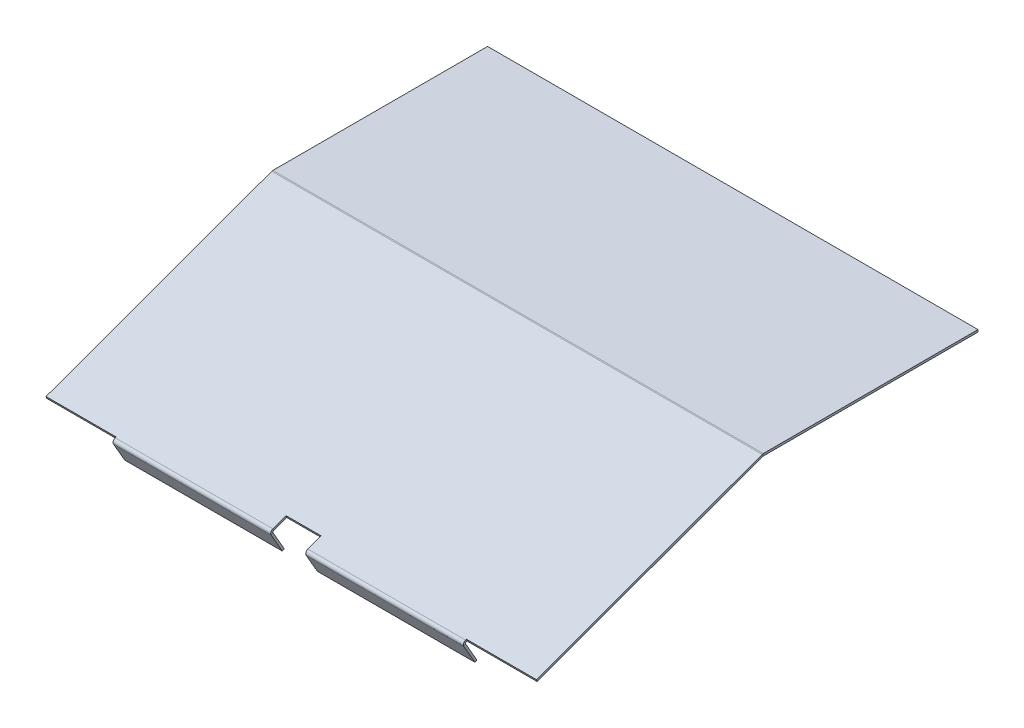
ISO-10303-21;
HEADER;
FILE_DESCRIPTION(('STEP AP214'),'2;1');
FILE_NAME('part.step','',(''),(''),'','','');
FILE_SCHEMA(('AUTOMOTIVE_DESIGN { 1 0 10303 214 1 1 1 1 }'));
ENDSEC;
DATA;
#1=APPLICATION_CONTEXT('core data for automotive mechanical design processes');
#2=APPLICATION_PROTOCOL_DEFINITION('international standard','automotive_design',2000,#1);
#3=PRODUCT_CONTEXT('',#1,'mechanical');
#4=PRODUCT('Part','Part','',(#3));
#5=PRODUCT_RELATED_PRODUCT_CATEGORY('part','',(#4));
#6=PRODUCT_DEFINITION_FORMATION('','',#4);
#7=PRODUCT_DEFINITION_CONTEXT('part definition',#1,'design');
#8=PRODUCT_DEFINITION('design','',#6,#7);
#9=PRODUCT_DEFINITION_SHAPE('','',#8);
#10=(LENGTH_UNIT() NAMED_UNIT(*) SI_UNIT(.MILLI.,.METRE.));
#11=(NAMED_UNIT(*) PLANE_ANGLE_UNIT() SI_UNIT($,.RADIAN.));
#12=(NAMED_UNIT(*) SI_UNIT($,.STERADIAN.) SOLID_ANGLE_UNIT());
#13=UNCERTAINTY_MEASURE_WITH_UNIT(LENGTH_MEASURE(1.E-05),#10,'distance_accuracy_value','');
#14=(GEOMETRIC_REPRESENTATION_CONTEXT(3) GLOBAL_UNCERTAINTY_ASSIGNED_CONTEXT((#13)) GLOBAL_UNIT_ASSIGNED_CONTEXT((#10,
#11,#12)) REPRESENTATION_CONTEXT('',''));
#15=CARTESIAN_POINT('',(0.,0.,0.));
#16=DIRECTION('',(0.,0.,1.));
#17=DIRECTION('',(1.,0.,0.));
#18=AXIS2_PLACEMENT_3D('',#15,#16,#17);
#19=CARTESIAN_POINT('',(0.,53.0658258986964,14.6728415986187));
#20=DIRECTION('',(0.,0.93969262078591,0.342020143325664));
#21=DIRECTION('',(0.,-0.342020143325664,0.93969262078591));
#22=AXIS2_PLACEMENT_3D('',#19,#20,#21);
#23=PLANE('',#22);
#24=DIRECTION('',(0.,0.342020143325664,-0.93969262078591));
#25=VECTOR('',#24,1.);
#26=CARTESIAN_POINT('',(190.5,-59.2236814833031,323.185727572351));
#27=LINE('',#26,#25);
#28=CARTESIAN_POINT('',(190.5,-58.3721076083425,320.846047579899));
#29=VERTEX_POINT('',#28);
#30=CARTESIAN_POINT('',(190.5,-54.8800256630671,311.25163128837));
#31=VERTEX_POINT('',#30);
#32=EDGE_CURVE('E437',#29,#31,#27,.T.);
#33=ORIENTED_EDGE('',*,*,#32,.F.);
#34=DIRECTION('',(-1.,0.,0.));
#35=VECTOR('',#34,1.);
#36=CARTESIAN_POINT('',(190.5,-58.3721076083425,320.846047579899));
#37=LINE('',#36,#35);
#38=CARTESIAN_POINT('',(304.8,-58.3721076083425,320.846047579899));
#39=VERTEX_POINT('',#38);
#40=EDGE_CURVE('E328',#29,#39,#37,.F.);
#41=ORIENTED_EDGE('',*,*,#40,.T.);
#42=DIRECTION('',(0.,-0.342020143325663,0.939692620785911));
#43=VECTOR('',#42,1.);
#44=CARTESIAN_POINT('',(304.8,-59.223681483303,323.185727572351));
#45=LINE('',#44,#43);
#46=CARTESIAN_POINT('',(304.8,-58.1006291195778,320.10016656215));
#47=VERTEX_POINT('',#46);
#48=EDGE_CURVE('E464',#47,#39,#45,.T.);
#49=ORIENTED_EDGE('',*,*,#48,.F.);
#50=DIRECTION('',(1.,0.,0.));
#51=VECTOR('',#50,1.);
#52=CARTESIAN_POINT('',(0.,-58.1006291195778,320.10016656215));
#53=LINE('',#52,#51);
#54=CARTESIAN_POINT('',(305.59375,-58.1006291195778,320.10016656215));
#55=VERTEX_POINT('',#54);
#56=EDGE_CURVE('E416',#47,#55,#53,.T.);
#57=ORIENTED_EDGE('',*,*,#56,.T.);
#58=DIRECTION('',(0.,-0.342020143325664,0.93969262078591));
#59=VECTOR('',#58,1.);
#60=CARTESIAN_POINT('',(305.59375,53.0658258986964,14.6728415986187));
#61=LINE('',#60,#59);
#62=CARTESIAN_POINT('',(305.59375,-58.1377675282441,320.202203501355));
#63=VERTEX_POINT('',#62);
#64=EDGE_CURVE('E406',#55,#63,#61,.T.);
#65=ORIENTED_EDGE('',*,*,#64,.T.);
#66=DIRECTION('',(-1.,0.,0.));
#67=VECTOR('',#66,1.);
#68=CARTESIAN_POINT('',(355.6,-58.1377675282441,320.202203501355));
#69=LINE('',#68,#67);
#70=CARTESIAN_POINT('',(355.6,-58.1377675282441,320.202203501355));
#71=VERTEX_POINT('',#70);
#72=EDGE_CURVE('E452',#71,#63,#69,.T.);
#73=ORIENTED_EDGE('',*,*,#72,.F.);
#74=DIRECTION('',(0.,-0.342020143325664,0.93969262078591));
#75=VECTOR('',#74,1.);
#76=CARTESIAN_POINT('',(355.6,-59.223681483303,323.185727572351));
#77=LINE('',#76,#75);
#78=CARTESIAN_POINT('',(355.6,1.44733961996853,156.493467075854));
#79=VERTEX_POINT('',#78);
#80=EDGE_CURVE('E476',#79,#71,#77,.T.);
#81=ORIENTED_EDGE('',*,*,#80,.F.);
#82=DIRECTION('',(-1.,0.,0.));
#83=VECTOR('',#82,1.);
#84=CARTESIAN_POINT('',(0.,1.44733961996851,156.493467075854));
#85=LINE('',#84,#83);
#86=CARTESIAN_POINT('',(0.,1.44733961996852,156.493467075854));
#87=VERTEX_POINT('',#86);
#88=EDGE_CURVE('E484',#79,#87,#85,.T.);
#89=ORIENTED_EDGE('',*,*,#88,.T.);
#90=DIRECTION('',(0.,0.342020143325664,-0.93969262078591));
#91=VECTOR('',#90,1.);
#92=CARTESIAN_POINT('',(0.,1.49176203549761,156.371417492271));
#93=LINE('',#92,#91);
#94=CARTESIAN_POINT('',(0.,-58.1377675282441,320.202203501355));
#95=VERTEX_POINT('',#94);
#96=EDGE_CURVE('E473',#95,#87,#93,.T.);
#97=ORIENTED_EDGE('',*,*,#96,.F.);
#98=DIRECTION('',(-1.,0.,0.));
#99=VECTOR('',#98,1.);
#100=CARTESIAN_POINT('',(0.,-58.1377675282441,320.202203501355));
#101=LINE('',#100,#99);
#102=CARTESIAN_POINT('',(50.00625,-58.1377675282441,320.202203501355));
#103=VERTEX_POINT('',#102);
#104=EDGE_CURVE('E455',#103,#95,#101,.T.);
#105=ORIENTED_EDGE('',*,*,#104,.F.);
#106=DIRECTION('',(0.,0.342020143325664,-0.93969262078591));
#107=VECTOR('',#106,1.);
#108=CARTESIAN_POINT('',(50.00625,53.0658258986964,14.6728415986187));
#109=LINE('',#108,#107);
#110=CARTESIAN_POINT('',(50.00625,-58.1006291195778,320.10016656215));
#111=VERTEX_POINT('',#110);
#112=EDGE_CURVE('E121',#103,#111,#109,.T.);
#113=ORIENTED_EDGE('',*,*,#112,.T.);
#114=DIRECTION('',(1.,0.,0.));
#115=VECTOR('',#114,1.);
#116=CARTESIAN_POINT('',(0.,-58.1006291195778,320.10016656215));
#117=LINE('',#116,#115);
#118=CARTESIAN_POINT('',(50.8,-58.1006291195778,320.10016656215));
#119=VERTEX_POINT('',#118);
#120=EDGE_CURVE('E432',#111,#119,#117,.T.);
#121=ORIENTED_EDGE('',*,*,#120,.T.);
#122=DIRECTION('',(0.,0.342020143325663,-0.939692620785911));
#123=VECTOR('',#122,1.);
#124=CARTESIAN_POINT('',(50.8,-59.223681483303,323.185727572351));
#125=LINE('',#124,#123);
#126=CARTESIAN_POINT('',(50.8,-58.3721076083425,320.846047579899));
#127=VERTEX_POINT('',#126);
#128=EDGE_CURVE('E453',#127,#119,#125,.T.);
#129=ORIENTED_EDGE('',*,*,#128,.F.);
#130=DIRECTION('',(-1.,0.,0.));
#131=VECTOR('',#130,1.);
#132=CARTESIAN_POINT('',(50.8,-58.3721076083425,320.846047579899));
#133=LINE('',#132,#131);
#134=CARTESIAN_POINT('',(165.1,-58.3721076083425,320.846047579899));
#135=VERTEX_POINT('',#134);
#136=EDGE_CURVE('E380',#127,#135,#133,.F.);
#137=ORIENTED_EDGE('',*,*,#136,.T.);
#138=DIRECTION('',(0.,-0.342020143325664,0.93969262078591));
#139=VECTOR('',#138,1.);
#140=CARTESIAN_POINT('',(165.1,-59.2236814833031,323.185727572351));
#141=LINE('',#140,#139);
#142=CARTESIAN_POINT('',(165.1,-54.8800256630671,311.25163128837));
#143=VERTEX_POINT('',#142);
#144=EDGE_CURVE('E434',#143,#135,#141,.T.);
#145=ORIENTED_EDGE('',*,*,#144,.F.);
#146=DIRECTION('',(-1.,0.,0.));
#147=VECTOR('',#146,1.);
#148=CARTESIAN_POINT('',(165.1,-54.8800256630671,311.25163128837));
#149=LINE('',#148,#147);
#150=EDGE_CURVE('E439',#31,#143,#149,.T.);
#151=ORIENTED_EDGE('',*,*,#150,.F.);
#152=EDGE_LOOP('',(#33,#41,#49,#57,#65,#73,#81,#89,#97,#105,#113,#121,#129,#137,#145,#151));
#153=FACE_BOUND('',#152,.T.);
#154=ADVANCED_FACE('F98',(#153),#23,.T.);
#155=CARTESIAN_POINT('',(0.,51.5740638631988,14.1298846210893));
#156=DIRECTION('',(0.,0.93969262078591,0.342020143325664));
#157=DIRECTION('',(0.,-0.342020143325664,0.93969262078591));
#158=AXIS2_PLACEMENT_3D('',#155,#156,#157);
#159=PLANE('',#158);
#160=DIRECTION('',(-1.,0.,0.));
#161=VECTOR('',#160,1.);
#162=CARTESIAN_POINT('',(190.5,-59.8638696438402,320.30309060237));
#163=LINE('',#162,#161);
#164=CARTESIAN_POINT('',(190.5,-59.8638696438402,320.30309060237));
#165=VERTEX_POINT('',#164);
#166=CARTESIAN_POINT('',(304.8,-59.8638696438402,320.30309060237));
#167=VERTEX_POINT('',#166);
#168=EDGE_CURVE('E339',#165,#167,#163,.F.);
#169=ORIENTED_EDGE('',*,*,#168,.F.);
#170=DIRECTION('',(0.,0.342020143325664,-0.93969262078591));
#171=VECTOR('',#170,1.);
#172=CARTESIAN_POINT('',(190.500000000001,51.5740638631986,14.1298846210896));
#173=LINE('',#172,#171);
#174=CARTESIAN_POINT('',(190.5,-56.3717876985648,310.70867431084));
#175=VERTEX_POINT('',#174);
#176=EDGE_CURVE('E445',#165,#175,#173,.T.);
#177=ORIENTED_EDGE('',*,*,#176,.T.);
#178=DIRECTION('',(-1.,0.,0.));
#179=VECTOR('',#178,1.);
#180=CARTESIAN_POINT('',(0.,-56.3717876985648,310.70867431084));
#181=LINE('',#180,#179);
#182=CARTESIAN_POINT('',(165.1,-56.3717876985648,310.70867431084));
#183=VERTEX_POINT('',#182);
#184=EDGE_CURVE('E543',#175,#183,#181,.T.);
#185=ORIENTED_EDGE('',*,*,#184,.T.);
#186=DIRECTION('',(0.,-0.342020143325664,0.93969262078591));
#187=VECTOR('',#186,1.);
#188=CARTESIAN_POINT('',(165.1,51.5740638631988,14.1298846210893));
#189=LINE('',#188,#187);
#190=CARTESIAN_POINT('',(165.1,-59.8638696438401,320.30309060237));
#191=VERTEX_POINT('',#190);
#192=EDGE_CURVE('E449',#183,#191,#189,.T.);
#193=ORIENTED_EDGE('',*,*,#192,.T.);
#194=DIRECTION('',(-1.,0.,0.));
#195=VECTOR('',#194,1.);
#196=CARTESIAN_POINT('',(50.8,-59.8638696438401,320.30309060237));
#197=LINE('',#196,#195);
#198=CARTESIAN_POINT('',(50.8,-59.8638696438401,320.30309060237));
#199=VERTEX_POINT('',#198);
#200=EDGE_CURVE('E393',#199,#191,#197,.F.);
#201=ORIENTED_EDGE('',*,*,#200,.F.);
#202=DIRECTION('',(0.,0.342020143325664,-0.93969262078591));
#203=VECTOR('',#202,1.);
#204=CARTESIAN_POINT('',(50.8,51.5740638631988,14.1298846210893));
#205=LINE('',#204,#203);
#206=CARTESIAN_POINT('',(50.8,-59.5923911550754,319.557209584621));
#207=VERTEX_POINT('',#206);
#208=EDGE_CURVE('E470',#199,#207,#205,.T.);
#209=ORIENTED_EDGE('',*,*,#208,.T.);
#210=DIRECTION('',(1.,0.,0.));
#211=VECTOR('',#210,1.);
#212=CARTESIAN_POINT('',(50.00625,-59.5923911550754,319.557209584621));
#213=LINE('',#212,#211);
#214=CARTESIAN_POINT('',(50.00625,-59.5923911550754,319.557209584621));
#215=VERTEX_POINT('',#214);
#216=EDGE_CURVE('E423',#215,#207,#213,.T.);
#217=ORIENTED_EDGE('',*,*,#216,.F.);
#218=DIRECTION('',(0.,0.342020143325665,-0.93969262078591));
#219=VECTOR('',#218,1.);
#220=CARTESIAN_POINT('',(50.00625,-60.7154435188006,322.642770594821));
#221=LINE('',#220,#219);
#222=CARTESIAN_POINT('',(50.00625,-59.6295295637417,319.659246523826));
#223=VERTEX_POINT('',#222);
#224=EDGE_CURVE('E420',#223,#215,#221,.T.);
#225=ORIENTED_EDGE('',*,*,#224,.F.);
#226=DIRECTION('',(-1.,0.,0.));
#227=VECTOR('',#226,1.);
#228=CARTESIAN_POINT('',(0.,-59.6295295637417,319.659246523826));
#229=LINE('',#228,#227);
#230=CARTESIAN_POINT('',(0.,-59.6295295637417,319.659246523826));
#231=VERTEX_POINT('',#230);
#232=EDGE_CURVE('E541',#223,#231,#229,.T.);
#233=ORIENTED_EDGE('',*,*,#232,.T.);
#234=DIRECTION('',(0.,-0.342020143325664,0.93969262078591));
#235=VECTOR('',#234,1.);
#236=CARTESIAN_POINT('',(0.,51.5740638631988,14.1298846210893));
#237=LINE('',#236,#235);
#238=CARTESIAN_POINT('',(0.,-0.0444224155290857,155.950510098325));
#239=VERTEX_POINT('',#238);
#240=EDGE_CURVE('E479',#231,#239,#237,.F.);
#241=ORIENTED_EDGE('',*,*,#240,.T.);
#242=DIRECTION('',(1.,0.,0.));
#243=VECTOR('',#242,1.);
#244=CARTESIAN_POINT('',(355.6,-0.0444224155291133,155.950510098325));
#245=LINE('',#244,#243);
#246=CARTESIAN_POINT('',(355.6,-0.0444224155291118,155.950510098325));
#247=VERTEX_POINT('',#246);
#248=EDGE_CURVE('E490',#247,#239,#245,.F.);
#249=ORIENTED_EDGE('',*,*,#248,.F.);
#250=DIRECTION('',(0.,0.342020143325664,-0.93969262078591));
#251=VECTOR('',#250,1.);
#252=CARTESIAN_POINT('',(355.6,51.5740638631988,14.1298846210893));
#253=LINE('',#252,#251);
#254=CARTESIAN_POINT('',(355.6,-59.6295295637417,319.659246523826));
#255=VERTEX_POINT('',#254);
#256=EDGE_CURVE('E481',#247,#255,#253,.F.);
#257=ORIENTED_EDGE('',*,*,#256,.T.);
#258=DIRECTION('',(-1.,0.,0.));
#259=VECTOR('',#258,1.);
#260=CARTESIAN_POINT('',(0.,-59.6295295637417,319.659246523826));
#261=LINE('',#260,#259);
#262=CARTESIAN_POINT('',(305.59375,-59.6295295637417,319.659246523826));
#263=VERTEX_POINT('',#262);
#264=EDGE_CURVE('E538',#255,#263,#261,.T.);
#265=ORIENTED_EDGE('',*,*,#264,.T.);
#266=DIRECTION('',(0.,-0.342020143325664,0.93969262078591));
#267=VECTOR('',#266,1.);
#268=CARTESIAN_POINT('',(305.59375,-59.5923911550754,319.557209584621));
#269=LINE('',#268,#267);
#270=CARTESIAN_POINT('',(305.59375,-59.5923911550754,319.557209584621));
#271=VERTEX_POINT('',#270);
#272=EDGE_CURVE('E408',#271,#263,#269,.T.);
#273=ORIENTED_EDGE('',*,*,#272,.F.);
#274=DIRECTION('',(1.,0.,0.));
#275=VECTOR('',#274,1.);
#276=CARTESIAN_POINT('',(304.8,-59.5923911550754,319.557209584621));
#277=LINE('',#276,#275);
#278=CARTESIAN_POINT('',(304.8,-59.5923911550754,319.557209584621));
#279=VERTEX_POINT('',#278);
#280=EDGE_CURVE('E403',#279,#271,#277,.T.);
#281=ORIENTED_EDGE('',*,*,#280,.F.);
#282=DIRECTION('',(0.,-0.342020143325664,0.93969262078591));
#283=VECTOR('',#282,1.);
#284=CARTESIAN_POINT('',(304.8,51.5740638631988,14.1298846210893));
#285=LINE('',#284,#283);
#286=EDGE_CURVE('E461',#279,#167,#285,.T.);
#287=ORIENTED_EDGE('',*,*,#286,.T.);
#288=EDGE_LOOP('',(#169,#177,#185,#193,#201,#209,#217,#225,#233,#241,#249,#257,#265,#273,#281,#287));
#289=FACE_BOUND('',#288,.T.);
#290=ADVANCED_FACE('F576',(#289),#159,.F.);
#291=CARTESIAN_POINT('',(355.6,-163.324917210384,281.917211989753));
#292=DIRECTION('',(0.,0.342020143325664,-0.93969262078591));
#293=DIRECTION('',(0.,0.93969262078591,0.342020143325664));
#294=AXIS2_PLACEMENT_3D('',#291,#292,#293);
#295=PLANE('',#294);
#296=DIRECTION('',(0.,0.93969262078591,0.342020143325664));
#297=VECTOR('',#296,1.);
#298=CARTESIAN_POINT('',(305.59375,-163.324917210384,281.917211989753));
#299=LINE('',#298,#297);
#300=EDGE_CURVE('E13',#263,#63,#299,.T.);
#301=ORIENTED_EDGE('',*,*,#300,.F.);
#302=ORIENTED_EDGE('',*,*,#264,.F.);
#303=DIRECTION('',(0.,0.93969262078591,0.342020143325664));
#304=VECTOR('',#303,1.);
#305=CARTESIAN_POINT('',(355.6,-163.324917210384,281.917211989753));
#306=LINE('',#305,#304);
#307=EDGE_CURVE('E456',#255,#71,#306,.T.);
#308=ORIENTED_EDGE('',*,*,#307,.T.);
#309=ORIENTED_EDGE('',*,*,#72,.T.);
#310=EDGE_LOOP('',(#301,#302,#308,#309));
#311=FACE_BOUND('',#310,.T.);
#312=ADVANCED_FACE('F583',(#311),#295,.F.);
#313=CARTESIAN_POINT('',(304.8,-164.410831165443,284.900736060749));
#314=DIRECTION('',(-1.,0.,0.));
#315=DIRECTION('',(0.,0.,1.));
#316=AXIS2_PLACEMENT_3D('',#313,#314,#315);
#317=PLANE('',#316);
#318=DIRECTION('',(0.,0.939692620785923,0.34202014332563));
#319=VECTOR('',#318,1.);
#320=CARTESIAN_POINT('',(304.8,-59.8638696438402,320.30309060237));
#321=LINE('',#320,#319);
#322=EDGE_CURVE('E343',#167,#39,#321,.T.);
#323=ORIENTED_EDGE('',*,*,#322,.F.);
#324=ORIENTED_EDGE('',*,*,#286,.F.);
#325=DIRECTION('',(0.,0.93969262078591,0.342020143325664));
#326=VECTOR('',#325,1.);
#327=CARTESIAN_POINT('',(304.8,-59.5923911550754,319.557209584621));
#328=LINE('',#327,#326);
#329=EDGE_CURVE('E407',#279,#47,#328,.T.);
#330=ORIENTED_EDGE('',*,*,#329,.T.);
#331=ORIENTED_EDGE('',*,*,#48,.T.);
#332=EDGE_LOOP('',(#323,#324,#330,#331));
#333=FACE_BOUND('',#332,.T.);
#334=ADVANCED_FACE('F594',(#333),#317,.F.);
#335=CARTESIAN_POINT('',(190.5,-164.410831165443,284.900736060749));
#336=DIRECTION('',(1.,0.,0.));
#337=DIRECTION('',(0.,0.,-1.));
#338=AXIS2_PLACEMENT_3D('',#335,#336,#337);
#339=PLANE('',#338);
#340=DIRECTION('',(0.,0.939692620785923,0.34202014332563));
#341=VECTOR('',#340,1.);
#342=CARTESIAN_POINT('',(190.5,-59.8638696438402,320.30309060237));
#343=LINE('',#342,#341);
#344=EDGE_CURVE('E333',#165,#29,#343,.T.);
#345=ORIENTED_EDGE('',*,*,#344,.T.);
#346=ORIENTED_EDGE('',*,*,#32,.T.);
#347=DIRECTION('',(0.,0.93969262078591,0.342020143325664));
#348=VECTOR('',#347,1.);
#349=CARTESIAN_POINT('',(190.5,-160.067175345207,272.966639776768));
#350=LINE('',#349,#348);
#351=EDGE_CURVE('E442',#175,#31,#350,.T.);
#352=ORIENTED_EDGE('',*,*,#351,.F.);
#353=ORIENTED_EDGE('',*,*,#176,.F.);
#354=EDGE_LOOP('',(#345,#346,#352,#353));
#355=FACE_BOUND('',#354,.T.);
#356=ADVANCED_FACE('F605',(#355),#339,.F.);
#357=CARTESIAN_POINT('',(0.,-163.324917210384,281.917211989753));
#358=DIRECTION('',(0.,0.342020143325664,-0.93969262078591));
#359=DIRECTION('',(0.,0.93969262078591,0.342020143325664));
#360=AXIS2_PLACEMENT_3D('',#357,#358,#359);
#361=PLANE('',#360);
#362=DIRECTION('',(0.,-0.93969262078591,-0.342020143325664));
#363=VECTOR('',#362,1.);
#364=CARTESIAN_POINT('',(50.00625,-163.324917210384,281.917211989753));
#365=LINE('',#364,#363);
#366=EDGE_CURVE('E106',#103,#223,#365,.T.);
#367=ORIENTED_EDGE('',*,*,#366,.F.);
#368=ORIENTED_EDGE('',*,*,#104,.T.);
#369=DIRECTION('',(0.,0.93969262078591,0.342020143325664));
#370=VECTOR('',#369,1.);
#371=CARTESIAN_POINT('',(0.,-163.324917210384,281.917211989753));
#372=LINE('',#371,#370);
#373=EDGE_CURVE('E458',#231,#95,#372,.T.);
#374=ORIENTED_EDGE('',*,*,#373,.F.);
#375=ORIENTED_EDGE('',*,*,#232,.F.);
#376=EDGE_LOOP('',(#367,#368,#374,#375));
#377=FACE_BOUND('',#376,.T.);
#378=ADVANCED_FACE('F551',(#377),#361,.F.);
#379=CARTESIAN_POINT('',(50.8,-164.410831165443,284.900736060749));
#380=DIRECTION('',(1.,0.,0.));
#381=DIRECTION('',(0.,0.,-1.));
#382=AXIS2_PLACEMENT_3D('',#379,#380,#381);
#383=PLANE('',#382);
#384=DIRECTION('',(0.,0.939692620785918,0.342020143325642));
#385=VECTOR('',#384,1.);
#386=CARTESIAN_POINT('',(50.8,-59.8638696438401,320.30309060237));
#387=LINE('',#386,#385);
#388=EDGE_CURVE('E387',#199,#127,#387,.T.);
#389=ORIENTED_EDGE('',*,*,#388,.T.);
#390=ORIENTED_EDGE('',*,*,#128,.T.);
#391=DIRECTION('',(0.,0.93969262078591,0.342020143325664));
#392=VECTOR('',#391,1.);
#393=CARTESIAN_POINT('',(50.8,-59.5923911550754,319.557209584621));
#394=LINE('',#393,#392);
#395=EDGE_CURVE('E419',#207,#119,#394,.T.);
#396=ORIENTED_EDGE('',*,*,#395,.F.);
#397=ORIENTED_EDGE('',*,*,#208,.F.);
#398=EDGE_LOOP('',(#389,#390,#396,#397));
#399=FACE_BOUND('',#398,.T.);
#400=ADVANCED_FACE('F621',(#399),#383,.F.);
#401=CARTESIAN_POINT('',(165.1,-164.410831165443,284.900736060749));
#402=DIRECTION('',(-1.,0.,0.));
#403=DIRECTION('',(0.,0.,1.));
#404=AXIS2_PLACEMENT_3D('',#401,#402,#403);
#405=PLANE('',#404);
#406=DIRECTION('',(0.,0.939692620785918,0.342020143325642));
#407=VECTOR('',#406,1.);
#408=CARTESIAN_POINT('',(165.1,-59.8638696438401,320.30309060237));
#409=LINE('',#408,#407);
#410=EDGE_CURVE('E397',#191,#135,#409,.T.);
#411=ORIENTED_EDGE('',*,*,#410,.F.);
#412=ORIENTED_EDGE('',*,*,#192,.F.);
#413=DIRECTION('',(0.,0.93969262078591,0.342020143325664));
#414=VECTOR('',#413,1.);
#415=CARTESIAN_POINT('',(165.1,-160.067175345207,272.966639776768));
#416=LINE('',#415,#414);
#417=EDGE_CURVE('E443',#183,#143,#416,.T.);
#418=ORIENTED_EDGE('',*,*,#417,.T.);
#419=ORIENTED_EDGE('',*,*,#144,.T.);
#420=EDGE_LOOP('',(#411,#412,#418,#419));
#421=FACE_BOUND('',#420,.T.);
#422=ADVANCED_FACE('F614',(#421),#405,.F.);
#423=CARTESIAN_POINT('',(355.6,1.5875,0.));
#424=DIRECTION('',(0.,-1.,0.));
#425=DIRECTION('',(0.,0.,-1.));
#426=AXIS2_PLACEMENT_3D('',#423,#424,#425);
#427=PLANE('',#426);
#428=DIRECTION('',(-1.,0.,0.));
#429=VECTOR('',#428,1.);
#430=CARTESIAN_POINT('',(0.,1.58750000000001,155.698578060751));
#431=LINE('',#430,#429);
#432=CARTESIAN_POINT('',(0.,1.58750000000001,155.698578060751));
#433=VERTEX_POINT('',#432);
#434=CARTESIAN_POINT('',(355.6,1.58749999999999,155.698578060751));
#435=VERTEX_POINT('',#434);
#436=EDGE_CURVE('E495',#433,#435,#431,.F.);
#437=ORIENTED_EDGE('',*,*,#436,.T.);
#438=DIRECTION('',(0.,0.,1.));
#439=VECTOR('',#438,1.);
#440=CARTESIAN_POINT('',(355.6,1.5875,0.));
#441=LINE('',#440,#439);
#442=CARTESIAN_POINT('',(355.6,1.5875,0.));
#443=VERTEX_POINT('',#442);
#444=EDGE_CURVE('E518',#443,#435,#441,.T.);
#445=ORIENTED_EDGE('',*,*,#444,.F.);
#446=DIRECTION('',(-1.,0.,0.));
#447=VECTOR('',#446,1.);
#448=CARTESIAN_POINT('',(355.6,1.5875,0.));
#449=LINE('',#448,#447);
#450=CARTESIAN_POINT('',(0.,1.5875,0.));
#451=VERTEX_POINT('',#450);
#452=EDGE_CURVE('E528',#443,#451,#449,.T.);
#453=ORIENTED_EDGE('',*,*,#452,.T.);
#454=DIRECTION('',(0.,0.,1.));
#455=VECTOR('',#454,1.);
#456=CARTESIAN_POINT('',(0.,1.5875,0.));
#457=LINE('',#456,#455);
#458=EDGE_CURVE('E515',#451,#433,#457,.T.);
#459=ORIENTED_EDGE('',*,*,#458,.T.);
#460=EDGE_LOOP('',(#437,#445,#453,#459));
#461=FACE_BOUND('',#460,.T.);
#462=ADVANCED_FACE('F100',(#461),#427,.F.);
#463=CARTESIAN_POINT('',(355.6,0.,0.));
#464=DIRECTION('',(0.,-1.,0.));
#465=DIRECTION('',(0.,0.,-1.));
#466=AXIS2_PLACEMENT_3D('',#463,#464,#465);
#467=PLANE('',#466);
#468=DIRECTION('',(0.,0.,1.));
#469=VECTOR('',#468,1.);
#470=CARTESIAN_POINT('',(355.6,0.,0.));
#471=LINE('',#470,#469);
#472=CARTESIAN_POINT('',(355.6,0.,0.));
#473=VERTEX_POINT('',#472);
#474=CARTESIAN_POINT('',(355.6,0.,155.698578060751));
#475=VERTEX_POINT('',#474);
#476=EDGE_CURVE('E521',#473,#475,#471,.T.);
#477=ORIENTED_EDGE('',*,*,#476,.T.);
#478=DIRECTION('',(-1.,0.,0.));
#479=VECTOR('',#478,1.);
#480=CARTESIAN_POINT('',(0.,0.,155.698578060751));
#481=LINE('',#480,#479);
#482=CARTESIAN_POINT('',(0.,0.,155.698578060751));
#483=VERTEX_POINT('',#482);
#484=EDGE_CURVE('E507',#483,#475,#481,.F.);
#485=ORIENTED_EDGE('',*,*,#484,.F.);
#486=DIRECTION('',(0.,0.,1.));
#487=VECTOR('',#486,1.);
#488=CARTESIAN_POINT('',(0.,0.,0.));
#489=LINE('',#488,#487);
#490=CARTESIAN_POINT('',(0.,0.,0.));
#491=VERTEX_POINT('',#490);
#492=EDGE_CURVE('E530',#491,#483,#489,.T.);
#493=ORIENTED_EDGE('',*,*,#492,.F.);
#494=DIRECTION('',(-1.,0.,0.));
#495=VECTOR('',#494,1.);
#496=CARTESIAN_POINT('',(355.6,0.,0.));
#497=LINE('',#496,#495);
#498=EDGE_CURVE('E536',#473,#491,#497,.T.);
#499=ORIENTED_EDGE('',*,*,#498,.F.);
#500=EDGE_LOOP('',(#477,#485,#493,#499));
#501=FACE_BOUND('',#500,.T.);
#502=ADVANCED_FACE('F689',(#501),#467,.T.);
#503=CARTESIAN_POINT('',(355.6,0.,0.));
#504=DIRECTION('',(-1.,0.,0.));
#505=DIRECTION('',(0.,0.,1.));
#506=AXIS2_PLACEMENT_3D('',#503,#504,#505);
#507=PLANE('',#506);
#508=DIRECTION('',(0.,1.,0.));
#509=VECTOR('',#508,1.);
#510=CARTESIAN_POINT('',(355.6,0.,155.698578060751));
#511=LINE('',#510,#509);
#512=EDGE_CURVE('E512',#475,#435,#511,.T.);
#513=ORIENTED_EDGE('',*,*,#512,.F.);
#514=ORIENTED_EDGE('',*,*,#476,.F.);
#515=DIRECTION('',(0.,-1.,0.));
#516=VECTOR('',#515,1.);
#517=CARTESIAN_POINT('',(355.6,1.5875,0.));
#518=LINE('',#517,#516);
#519=EDGE_CURVE('E525',#443,#473,#518,.T.);
#520=ORIENTED_EDGE('',*,*,#519,.F.);
#521=ORIENTED_EDGE('',*,*,#444,.T.);
#522=EDGE_LOOP('',(#513,#514,#520,#521));
#523=FACE_BOUND('',#522,.T.);
#524=ADVANCED_FACE('F685',(#523),#507,.F.);
#525=CARTESIAN_POINT('',(0.,0.,0.));
#526=DIRECTION('',(-1.,0.,0.));
#527=DIRECTION('',(0.,0.,1.));
#528=AXIS2_PLACEMENT_3D('',#525,#526,#527);
#529=PLANE('',#528);
#530=ORIENTED_EDGE('',*,*,#492,.T.);
#531=DIRECTION('',(0.,1.,0.));
#532=VECTOR('',#531,1.);
#533=CARTESIAN_POINT('',(0.,0.,155.698578060751));
#534=LINE('',#533,#532);
#535=EDGE_CURVE('E501',#483,#433,#534,.T.);
#536=ORIENTED_EDGE('',*,*,#535,.T.);
#537=ORIENTED_EDGE('',*,*,#458,.F.);
#538=DIRECTION('',(0.,-1.,0.));
#539=VECTOR('',#538,1.);
#540=CARTESIAN_POINT('',(0.,1.5875,0.));
#541=LINE('',#540,#539);
#542=EDGE_CURVE('E522',#451,#491,#541,.T.);
#543=ORIENTED_EDGE('',*,*,#542,.T.);
#544=EDGE_LOOP('',(#530,#536,#537,#543));
#545=FACE_BOUND('',#544,.T.);
#546=ADVANCED_FACE('F688',(#545),#529,.T.);
#547=CARTESIAN_POINT('',(355.6,1.5875,0.));
#548=DIRECTION('',(0.,0.,-1.));
#549=DIRECTION('',(0.,1.,0.));
#550=AXIS2_PLACEMENT_3D('',#547,#548,#549);
#551=PLANE('',#550);
#552=ORIENTED_EDGE('',*,*,#542,.F.);
#553=ORIENTED_EDGE('',*,*,#452,.F.);
#554=ORIENTED_EDGE('',*,*,#519,.T.);
#555=ORIENTED_EDGE('',*,*,#498,.T.);
#556=EDGE_LOOP('',(#552,#553,#554,#555));
#557=FACE_BOUND('',#556,.T.);
#558=ADVANCED_FACE('F681',(#557),#551,.T.);
#559=CARTESIAN_POINT('',(355.6,-0.736600000000008,155.698578060751));
#560=DIRECTION('',(1.,0.,0.));
#561=DIRECTION('',(0.,1.,0.));
#562=AXIS2_PLACEMENT_3D('',#559,#560,#561);
#563=PLANE('',#562);
#564=DIRECTION('',(0.,0.93969262078591,0.342020143325664));
#565=VECTOR('',#564,1.);
#566=CARTESIAN_POINT('',(355.6,1.44733961996852,156.493467075854));
#567=LINE('',#566,#565);
#568=EDGE_CURVE('E472',#247,#79,#567,.T.);
#569=ORIENTED_EDGE('',*,*,#568,.F.);
#570=CARTESIAN_POINT('',(355.6,-0.736600000000008,155.698578060751));
#571=DIRECTION('',(-1.,0.,0.));
#572=DIRECTION('',(0.,-1.,0.));
#573=AXIS2_PLACEMENT_3D('',#570,#571,#572);
#574=CIRCLE('',#573,0.736599999999995);
#575=EDGE_CURVE('E504',#475,#247,#574,.F.);
#576=ORIENTED_EDGE('',*,*,#575,.F.);
#577=ORIENTED_EDGE('',*,*,#512,.T.);
#578=CARTESIAN_POINT('',(355.6,-0.736600000000008,155.698578060751));
#579=DIRECTION('',(-1.,0.,0.));
#580=DIRECTION('',(0.,-1.,0.));
#581=AXIS2_PLACEMENT_3D('',#578,#579,#580);
#582=CIRCLE('',#581,2.32409999999999);
#583=EDGE_CURVE('E497',#435,#79,#582,.F.);
#584=ORIENTED_EDGE('',*,*,#583,.T.);
#585=EDGE_LOOP('',(#569,#576,#577,#584));
#586=FACE_BOUND('',#585,.T.);
#587=ADVANCED_FACE('F678',(#586),#563,.T.);
#588=CARTESIAN_POINT('',(0.,-0.736599999999982,155.698578060751));
#589=DIRECTION('',(1.,0.,0.));
#590=DIRECTION('',(0.,1.,0.));
#591=AXIS2_PLACEMENT_3D('',#588,#589,#590);
#592=PLANE('',#591);
#593=CARTESIAN_POINT('',(0.,-0.736599999999982,155.698578060751));
#594=DIRECTION('',(-1.,0.,0.));
#595=DIRECTION('',(0.,-1.,0.));
#596=AXIS2_PLACEMENT_3D('',#593,#594,#595);
#597=CIRCLE('',#596,0.736599999999995);
#598=EDGE_CURVE('E475',#239,#483,#597,.T.);
#599=ORIENTED_EDGE('',*,*,#598,.F.);
#600=DIRECTION('',(0.,0.93969262078591,0.342020143325664));
#601=VECTOR('',#600,1.);
#602=CARTESIAN_POINT('',(0.,-0.0444224155291198,155.950510098325));
#603=LINE('',#602,#601);
#604=EDGE_CURVE('E487',#239,#87,#603,.T.);
#605=ORIENTED_EDGE('',*,*,#604,.T.);
#606=CARTESIAN_POINT('',(0.,-0.736599999999982,155.698578060751));
#607=DIRECTION('',(-1.,0.,0.));
#608=DIRECTION('',(0.,-1.,0.));
#609=AXIS2_PLACEMENT_3D('',#606,#607,#608);
#610=CIRCLE('',#609,2.32409999999999);
#611=EDGE_CURVE('E498',#87,#433,#610,.T.);
#612=ORIENTED_EDGE('',*,*,#611,.T.);
#613=ORIENTED_EDGE('',*,*,#535,.F.);
#614=EDGE_LOOP('',(#599,#605,#612,#613));
#615=FACE_BOUND('',#614,.T.);
#616=ADVANCED_FACE('F568',(#615),#592,.F.);
#617=CARTESIAN_POINT('',(0.,-0.736599999999982,155.698578060751));
#618=DIRECTION('',(-1.,0.,0.));
#619=DIRECTION('',(0.,0.93969262078591,0.342020143325664));
#620=AXIS2_PLACEMENT_3D('',#617,#618,#619);
#621=CYLINDRICAL_SURFACE('',#620,2.32409999999999);
#622=ORIENTED_EDGE('',*,*,#436,.F.);
#623=ORIENTED_EDGE('',*,*,#611,.F.);
#624=ORIENTED_EDGE('',*,*,#88,.F.);
#625=ORIENTED_EDGE('',*,*,#583,.F.);
#626=EDGE_LOOP('',(#622,#623,#624,#625));
#627=FACE_BOUND('',#626,.T.);
#628=ADVANCED_FACE('F563',(#627),#621,.T.);
#629=CARTESIAN_POINT('',(0.,-0.736599999999982,155.698578060751));
#630=DIRECTION('',(-1.,0.,0.));
#631=DIRECTION('',(0.,0.93969262078591,0.342020143325664));
#632=AXIS2_PLACEMENT_3D('',#629,#630,#631);
#633=CYLINDRICAL_SURFACE('',#632,0.736599999999995);
#634=ORIENTED_EDGE('',*,*,#484,.T.);
#635=ORIENTED_EDGE('',*,*,#575,.T.);
#636=ORIENTED_EDGE('',*,*,#248,.T.);
#637=ORIENTED_EDGE('',*,*,#598,.T.);
#638=EDGE_LOOP('',(#634,#635,#636,#637));
#639=FACE_BOUND('',#638,.T.);
#640=ADVANCED_FACE('F570',(#639),#633,.F.);
#641=CARTESIAN_POINT('',(0.,1.49176203549761,156.371417492271));
#642=DIRECTION('',(-1.,0.,0.));
#643=DIRECTION('',(0.,0.,1.));
#644=AXIS2_PLACEMENT_3D('',#641,#642,#643);
#645=PLANE('',#644);
#646=ORIENTED_EDGE('',*,*,#373,.T.);
#647=ORIENTED_EDGE('',*,*,#96,.T.);
#648=ORIENTED_EDGE('',*,*,#604,.F.);
#649=ORIENTED_EDGE('',*,*,#240,.F.);
#650=EDGE_LOOP('',(#646,#647,#648,#649));
#651=FACE_BOUND('',#650,.T.);
#652=ADVANCED_FACE('F559',(#651),#645,.T.);
#653=CARTESIAN_POINT('',(355.6,-59.223681483303,323.185727572351));
#654=DIRECTION('',(1.,0.,0.));
#655=DIRECTION('',(0.,0.,-1.));
#656=AXIS2_PLACEMENT_3D('',#653,#654,#655);
#657=PLANE('',#656);
#658=ORIENTED_EDGE('',*,*,#307,.F.);
#659=ORIENTED_EDGE('',*,*,#256,.F.);
#660=ORIENTED_EDGE('',*,*,#568,.T.);
#661=ORIENTED_EDGE('',*,*,#80,.T.);
#662=EDGE_LOOP('',(#658,#659,#660,#661));
#663=FACE_BOUND('',#662,.T.);
#664=ADVANCED_FACE('F579',(#663),#657,.T.);
#665=CARTESIAN_POINT('',(165.1,-160.067175345207,272.966639776768));
#666=DIRECTION('',(0.,0.342020143325664,-0.93969262078591));
#667=DIRECTION('',(0.,0.93969262078591,0.342020143325664));
#668=AXIS2_PLACEMENT_3D('',#665,#666,#667);
#669=PLANE('',#668);
#670=ORIENTED_EDGE('',*,*,#351,.T.);
#671=ORIENTED_EDGE('',*,*,#150,.T.);
#672=ORIENTED_EDGE('',*,*,#417,.F.);
#673=ORIENTED_EDGE('',*,*,#184,.F.);
#674=EDGE_LOOP('',(#670,#671,#672,#673));
#675=FACE_BOUND('',#674,.T.);
#676=ADVANCED_FACE('F610',(#675),#669,.F.);
#677=CARTESIAN_POINT('',(50.00625,-60.7154435188006,322.642770594821));
#678=DIRECTION('',(1.,0.,0.));
#679=DIRECTION('',(0.,0.,-1.));
#680=AXIS2_PLACEMENT_3D('',#677,#678,#679);
#681=PLANE('',#680);
#682=ORIENTED_EDGE('',*,*,#112,.F.);
#683=ORIENTED_EDGE('',*,*,#366,.T.);
#684=ORIENTED_EDGE('',*,*,#224,.T.);
#685=DIRECTION('',(0.,0.93969262078591,0.342020143325664));
#686=VECTOR('',#685,1.);
#687=CARTESIAN_POINT('',(50.00625,-59.5923911550754,319.557209584621));
#688=LINE('',#687,#686);
#689=EDGE_CURVE('E426',#215,#111,#688,.T.);
#690=ORIENTED_EDGE('',*,*,#689,.T.);
#691=EDGE_LOOP('',(#682,#683,#684,#690));
#692=FACE_BOUND('',#691,.T.);
#693=ADVANCED_FACE('F547',(#692),#681,.T.);
#694=CARTESIAN_POINT('',(50.00625,-59.5923911550754,319.557209584621));
#695=DIRECTION('',(0.,-0.342020143325664,0.93969262078591));
#696=DIRECTION('',(0.,-0.93969262078591,-0.342020143325664));
#697=AXIS2_PLACEMENT_3D('',#694,#695,#696);
#698=PLANE('',#697);
#699=ORIENTED_EDGE('',*,*,#120,.F.);
#700=ORIENTED_EDGE('',*,*,#689,.F.);
#701=ORIENTED_EDGE('',*,*,#216,.T.);
#702=ORIENTED_EDGE('',*,*,#395,.T.);
#703=EDGE_LOOP('',(#699,#700,#701,#702));
#704=FACE_BOUND('',#703,.T.);
#705=ADVANCED_FACE('F624',(#704),#698,.T.);
#706=CARTESIAN_POINT('',(304.8,-59.5923911550754,319.557209584621));
#707=DIRECTION('',(0.,-0.342020143325664,0.93969262078591));
#708=DIRECTION('',(0.,-0.93969262078591,-0.342020143325664));
#709=AXIS2_PLACEMENT_3D('',#706,#707,#708);
#710=PLANE('',#709);
#711=ORIENTED_EDGE('',*,*,#56,.F.);
#712=ORIENTED_EDGE('',*,*,#329,.F.);
#713=ORIENTED_EDGE('',*,*,#280,.T.);
#714=DIRECTION('',(0.,0.93969262078591,0.342020143325664));
#715=VECTOR('',#714,1.);
#716=CARTESIAN_POINT('',(305.59375,-59.5923911550754,319.557209584621));
#717=LINE('',#716,#715);
#718=EDGE_CURVE('E400',#271,#55,#717,.T.);
#719=ORIENTED_EDGE('',*,*,#718,.T.);
#720=EDGE_LOOP('',(#711,#712,#713,#719));
#721=FACE_BOUND('',#720,.T.);
#722=ADVANCED_FACE('F588',(#721),#710,.T.);
#723=CARTESIAN_POINT('',(305.59375,-59.5923911550754,319.557209584621));
#724=DIRECTION('',(-1.,0.,0.));
#725=DIRECTION('',(0.,0.,1.));
#726=AXIS2_PLACEMENT_3D('',#723,#724,#725);
#727=PLANE('',#726);
#728=ORIENTED_EDGE('',*,*,#64,.F.);
#729=ORIENTED_EDGE('',*,*,#718,.F.);
#730=ORIENTED_EDGE('',*,*,#272,.T.);
#731=ORIENTED_EDGE('',*,*,#300,.T.);
#732=EDGE_LOOP('',(#728,#729,#730,#731));
#733=FACE_BOUND('',#732,.T.);
#734=ADVANCED_FACE('F586',(#733),#727,.T.);
#735=CARTESIAN_POINT('',(165.1,-60.5560472283111,320.051158564796));
#736=DIRECTION('',(1.,0.,0.));
#737=DIRECTION('',(0.,0.,-1.));
#738=AXIS2_PLACEMENT_3D('',#735,#736,#737);
#739=PLANE('',#738);
#740=DIRECTION('',(0.,-0.499999999999994,0.866025403784442));
#741=VECTOR('',#740,1.);
#742=CARTESIAN_POINT('',(165.1,-61.718097228311,322.063888205731));
#743=LINE('',#742,#741);
#744=CARTESIAN_POINT('',(165.1,-60.9243472283111,320.689072877224));
#745=VERTEX_POINT('',#744);
#746=CARTESIAN_POINT('',(165.1,-61.718097228311,322.063888205731));
#747=VERTEX_POINT('',#746);
#748=EDGE_CURVE('E345',#745,#747,#743,.T.);
#749=ORIENTED_EDGE('',*,*,#748,.F.);
#750=CARTESIAN_POINT('',(165.1,-60.5560472283111,320.051158564796));
#751=DIRECTION('',(-1.,0.,0.));
#752=DIRECTION('',(0.,0.,1.));
#753=AXIS2_PLACEMENT_3D('',#750,#751,#752);
#754=CIRCLE('',#753,0.736600000000028);
#755=EDGE_CURVE('E390',#191,#745,#754,.F.);
#756=ORIENTED_EDGE('',*,*,#755,.F.);
#757=ORIENTED_EDGE('',*,*,#410,.T.);
#758=CARTESIAN_POINT('',(165.1,-60.5560472283111,320.051158564796));
#759=DIRECTION('',(-1.,0.,0.));
#760=DIRECTION('',(0.,0.,1.));
#761=AXIS2_PLACEMENT_3D('',#758,#759,#760);
#762=CIRCLE('',#761,2.32410000000003);
#763=EDGE_CURVE('E383',#135,#747,#762,.F.);
#764=ORIENTED_EDGE('',*,*,#763,.T.);
#765=EDGE_LOOP('',(#749,#756,#757,#764));
#766=FACE_BOUND('',#765,.T.);
#767=ADVANCED_FACE('F647',(#766),#739,.T.);
#768=CARTESIAN_POINT('',(50.8,-60.5560472283111,320.051158564796));
#769=DIRECTION('',(1.,0.,0.));
#770=DIRECTION('',(0.,0.,-1.));
#771=AXIS2_PLACEMENT_3D('',#768,#769,#770);
#772=PLANE('',#771);
#773=CARTESIAN_POINT('',(50.8,-60.5560472283111,320.051158564796));
#774=DIRECTION('',(-1.,0.,0.));
#775=DIRECTION('',(0.,0.,1.));
#776=AXIS2_PLACEMENT_3D('',#773,#774,#775);
#777=CIRCLE('',#776,0.736600000000028);
#778=CARTESIAN_POINT('',(50.8,-60.9243472283111,320.689072877224));
#779=VERTEX_POINT('',#778);
#780=EDGE_CURVE('E350',#779,#199,#777,.T.);
#781=ORIENTED_EDGE('',*,*,#780,.F.);
#782=DIRECTION('',(0.,-0.499999999999994,0.866025403784442));
#783=VECTOR('',#782,1.);
#784=CARTESIAN_POINT('',(50.8,-60.924347228311,320.689072877223));
#785=LINE('',#784,#783);
#786=CARTESIAN_POINT('',(50.8,-61.718097228311,322.063888205731));
#787=VERTEX_POINT('',#786);
#788=EDGE_CURVE('E373',#779,#787,#785,.T.);
#789=ORIENTED_EDGE('',*,*,#788,.T.);
#790=CARTESIAN_POINT('',(50.8,-60.5560472283111,320.051158564796));
#791=DIRECTION('',(-1.,0.,0.));
#792=DIRECTION('',(0.,0.,1.));
#793=AXIS2_PLACEMENT_3D('',#790,#791,#792);
#794=CIRCLE('',#793,2.32410000000003);
#795=EDGE_CURVE('E384',#787,#127,#794,.T.);
#796=ORIENTED_EDGE('',*,*,#795,.T.);
#797=ORIENTED_EDGE('',*,*,#388,.F.);
#798=EDGE_LOOP('',(#781,#789,#796,#797));
#799=FACE_BOUND('',#798,.T.);
#800=ADVANCED_FACE('F629',(#799),#772,.F.);
#801=CARTESIAN_POINT('',(50.8,-60.5560472283111,320.051158564796));
#802=DIRECTION('',(-1.,0.,0.));
#803=DIRECTION('',(0.,-0.499999999999994,0.866025403784442));
#804=AXIS2_PLACEMENT_3D('',#801,#802,#803);
#805=CYLINDRICAL_SURFACE('',#804,2.32410000000003);
#806=ORIENTED_EDGE('',*,*,#136,.F.);
#807=ORIENTED_EDGE('',*,*,#795,.F.);
#808=DIRECTION('',(-1.,0.,0.));
#809=VECTOR('',#808,1.);
#810=CARTESIAN_POINT('',(-3.41081014079067E-13,-61.718097228311,322.063888205731));
#811=LINE('',#810,#809);
#812=EDGE_CURVE('E370',#747,#787,#811,.T.);
#813=ORIENTED_EDGE('',*,*,#812,.F.);
#814=ORIENTED_EDGE('',*,*,#763,.F.);
#815=EDGE_LOOP('',(#806,#807,#813,#814));
#816=FACE_BOUND('',#815,.T.);
#817=ADVANCED_FACE('F626',(#816),#805,.T.);
#818=CARTESIAN_POINT('',(50.8,-60.5560472283111,320.051158564796));
#819=DIRECTION('',(-1.,0.,0.));
#820=DIRECTION('',(0.,-0.499999999999994,0.866025403784442));
#821=AXIS2_PLACEMENT_3D('',#818,#819,#820);
#822=CYLINDRICAL_SURFACE('',#821,0.736600000000028);
#823=ORIENTED_EDGE('',*,*,#200,.T.);
#824=ORIENTED_EDGE('',*,*,#755,.T.);
#825=DIRECTION('',(1.,0.,0.));
#826=VECTOR('',#825,1.);
#827=CARTESIAN_POINT('',(165.1,-60.924347228311,320.689072877224));
#828=LINE('',#827,#826);
#829=EDGE_CURVE('E376',#745,#779,#828,.F.);
#830=ORIENTED_EDGE('',*,*,#829,.T.);
#831=ORIENTED_EDGE('',*,*,#780,.T.);
#832=EDGE_LOOP('',(#823,#824,#830,#831));
#833=FACE_BOUND('',#832,.T.);
#834=ADVANCED_FACE('F649',(#833),#822,.F.);
#835=CARTESIAN_POINT('',(50.8,-60.9578605547081,322.502811053884));
#836=DIRECTION('',(-1.,0.,0.));
#837=DIRECTION('',(0.,-1.,0.));
#838=AXIS2_PLACEMENT_3D('',#835,#836,#837);
#839=PLANE('',#838);
#840=DIRECTION('',(0.,0.866025403784442,0.499999999999994));
#841=VECTOR('',#840,1.);
#842=CARTESIAN_POINT('',(50.8,-60.9578605547081,322.502811053884));
#843=LINE('',#842,#841);
#844=CARTESIAN_POINT('',(50.7999999999996,-75.817203389899,313.923765468006));
#845=VERTEX_POINT('',#844);
#846=EDGE_CURVE('E354',#845,#787,#843,.T.);
#847=ORIENTED_EDGE('',*,*,#846,.T.);
#848=ORIENTED_EDGE('',*,*,#788,.F.);
#849=DIRECTION('',(0.,-0.866025403784442,-0.499999999999994));
#850=VECTOR('',#849,1.);
#851=CARTESIAN_POINT('',(50.7999999999973,-154.335945756862,266.757861321332));
#852=LINE('',#851,#850);
#853=CARTESIAN_POINT('',(50.7999999999996,-75.023453389899,312.548950139498));
#854=VERTEX_POINT('',#853);
#855=EDGE_CURVE('E362',#854,#779,#852,.F.);
#856=ORIENTED_EDGE('',*,*,#855,.F.);
#857=DIRECTION('',(0.,0.499999999999993,-0.866025403784443));
#858=VECTOR('',#857,1.);
#859=CARTESIAN_POINT('',(50.7999999999996,-75.817203389899,313.923765468005));
#860=LINE('',#859,#858);
#861=EDGE_CURVE('E348',#845,#854,#860,.T.);
#862=ORIENTED_EDGE('',*,*,#861,.F.);
#863=EDGE_LOOP('',(#847,#848,#856,#862));
#864=FACE_BOUND('',#863,.T.);
#865=ADVANCED_FACE('F638',(#864),#839,.T.);
#866=CARTESIAN_POINT('',(165.1,-75.817203389899,313.923765468006));
#867=DIRECTION('',(1.,0.,0.));
#868=DIRECTION('',(0.,1.,0.));
#869=AXIS2_PLACEMENT_3D('',#866,#867,#868);
#870=PLANE('',#869);
#871=DIRECTION('',(0.,0.866025403784442,0.499999999999994));
#872=VECTOR('',#871,1.);
#873=CARTESIAN_POINT('',(165.099999999997,-154.335945756864,266.757861321331));
#874=LINE('',#873,#872);
#875=CARTESIAN_POINT('',(165.1,-75.023453389899,312.548950139498));
#876=VERTEX_POINT('',#875);
#877=EDGE_CURVE('E368',#745,#876,#874,.F.);
#878=ORIENTED_EDGE('',*,*,#877,.F.);
#879=ORIENTED_EDGE('',*,*,#748,.T.);
#880=DIRECTION('',(0.,-0.866025403784442,-0.499999999999994));
#881=VECTOR('',#880,1.);
#882=CARTESIAN_POINT('',(165.1,-75.817203389899,313.923765468006));
#883=LINE('',#882,#881);
#884=CARTESIAN_POINT('',(165.1,-75.817203389899,313.923765468006));
#885=VERTEX_POINT('',#884);
#886=EDGE_CURVE('E360',#747,#885,#883,.T.);
#887=ORIENTED_EDGE('',*,*,#886,.T.);
#888=DIRECTION('',(0.,0.499999999999993,-0.866025403784443));
#889=VECTOR('',#888,1.);
#890=CARTESIAN_POINT('',(165.1,-75.817203389899,313.923765468006));
#891=LINE('',#890,#889);
#892=EDGE_CURVE('E351',#885,#876,#891,.T.);
#893=ORIENTED_EDGE('',*,*,#892,.T.);
#894=EDGE_LOOP('',(#878,#879,#887,#893));
#895=FACE_BOUND('',#894,.T.);
#896=ADVANCED_FACE('F645',(#895),#870,.T.);
#897=CARTESIAN_POINT('',(-2.886963484489E-13,-155.129695756861,268.132676649841));
#898=DIRECTION('',(0.,-0.499999999999994,0.866025403784442));
#899=DIRECTION('',(0.,-0.866025403784442,-0.499999999999994));
#900=AXIS2_PLACEMENT_3D('',#897,#898,#899);
#901=PLANE('',#900);
#902=ORIENTED_EDGE('',*,*,#886,.F.);
#903=ORIENTED_EDGE('',*,*,#812,.T.);
#904=ORIENTED_EDGE('',*,*,#846,.F.);
#905=DIRECTION('',(-1.,0.,0.));
#906=VECTOR('',#905,1.);
#907=CARTESIAN_POINT('',(50.7999999999996,-75.817203389899,313.923765468006));
#908=LINE('',#907,#906);
#909=EDGE_CURVE('E357',#885,#845,#908,.T.);
#910=ORIENTED_EDGE('',*,*,#909,.F.);
#911=EDGE_LOOP('',(#902,#903,#904,#910));
#912=FACE_BOUND('',#911,.T.);
#913=ADVANCED_FACE('F636',(#912),#901,.T.);
#914=CARTESIAN_POINT('',(-2.87216397404803E-13,-154.335945756861,266.757861321333));
#915=DIRECTION('',(0.,-0.499999999999994,0.866025403784442));
#916=DIRECTION('',(0.,-0.866025403784442,-0.499999999999994));
#917=AXIS2_PLACEMENT_3D('',#914,#915,#916);
#918=PLANE('',#917);
#919=ORIENTED_EDGE('',*,*,#829,.F.);
#920=ORIENTED_EDGE('',*,*,#877,.T.);
#921=DIRECTION('',(1.,0.,0.));
#922=VECTOR('',#921,1.);
#923=CARTESIAN_POINT('',(-3.12434842144112E-13,-75.023453389899,312.548950139498));
#924=LINE('',#923,#922);
#925=EDGE_CURVE('E365',#876,#854,#924,.F.);
#926=ORIENTED_EDGE('',*,*,#925,.T.);
#927=ORIENTED_EDGE('',*,*,#855,.T.);
#928=EDGE_LOOP('',(#919,#920,#926,#927));
#929=FACE_BOUND('',#928,.T.);
#930=ADVANCED_FACE('F651',(#929),#918,.F.);
#931=CARTESIAN_POINT('',(50.7999999999996,-75.817203389899,313.923765468005));
#932=DIRECTION('',(0.,-0.866025403784443,-0.499999999999993));
#933=DIRECTION('',(0.,0.499999999999993,-0.866025403784443));
#934=AXIS2_PLACEMENT_3D('',#931,#932,#933);
#935=PLANE('',#934);
#936=ORIENTED_EDGE('',*,*,#925,.F.);
#937=ORIENTED_EDGE('',*,*,#892,.F.);
#938=ORIENTED_EDGE('',*,*,#909,.T.);
#939=ORIENTED_EDGE('',*,*,#861,.T.);
#940=EDGE_LOOP('',(#936,#937,#938,#939));
#941=FACE_BOUND('',#940,.T.);
#942=ADVANCED_FACE('F642',(#941),#935,.T.);
#943=CARTESIAN_POINT('',(304.8,-60.5560472283111,320.051158564796));
#944=DIRECTION('',(1.,0.,0.));
#945=DIRECTION('',(0.,0.,-1.));
#946=AXIS2_PLACEMENT_3D('',#943,#944,#945);
#947=PLANE('',#946);
#948=DIRECTION('',(0.,-0.499999999999992,0.866025403784443));
#949=VECTOR('',#948,1.);
#950=CARTESIAN_POINT('',(304.8,-61.7180972283111,322.063888205731));
#951=LINE('',#950,#949);
#952=CARTESIAN_POINT('',(304.8,-60.9243472283111,320.689072877224));
#953=VERTEX_POINT('',#952);
#954=CARTESIAN_POINT('',(304.8,-61.7180972283111,322.063888205731));
#955=VERTEX_POINT('',#954);
#956=EDGE_CURVE('E325',#953,#955,#951,.T.);
#957=ORIENTED_EDGE('',*,*,#956,.F.);
#958=CARTESIAN_POINT('',(304.8,-60.5560472283111,320.051158564796));
#959=DIRECTION('',(-1.,0.,0.));
#960=DIRECTION('',(0.,0.,1.));
#961=AXIS2_PLACEMENT_3D('',#958,#959,#960);
#962=CIRCLE('',#961,0.736600000000052);
#963=EDGE_CURVE('E336',#167,#953,#962,.F.);
#964=ORIENTED_EDGE('',*,*,#963,.F.);
#965=ORIENTED_EDGE('',*,*,#322,.T.);
#966=CARTESIAN_POINT('',(304.8,-60.5560472283111,320.051158564796));
#967=DIRECTION('',(-1.,0.,0.));
#968=DIRECTION('',(0.,0.,1.));
#969=AXIS2_PLACEMENT_3D('',#966,#967,#968);
#970=CIRCLE('',#969,2.32410000000005);
#971=EDGE_CURVE('E113',#39,#955,#970,.F.);
#972=ORIENTED_EDGE('',*,*,#971,.T.);
#973=EDGE_LOOP('',(#957,#964,#965,#972));
#974=FACE_BOUND('',#973,.T.);
#975=ADVANCED_FACE('F597',(#974),#947,.T.);
#976=CARTESIAN_POINT('',(190.5,-60.5560472283111,320.051158564796));
#977=DIRECTION('',(1.,0.,0.));
#978=DIRECTION('',(0.,0.,-1.));
#979=AXIS2_PLACEMENT_3D('',#976,#977,#978);
#980=PLANE('',#979);
#981=CARTESIAN_POINT('',(190.5,-60.5560472283111,320.051158564796));
#982=DIRECTION('',(-1.,0.,0.));
#983=DIRECTION('',(0.,0.,1.));
#984=AXIS2_PLACEMENT_3D('',#981,#982,#983);
#985=CIRCLE('',#984,0.736600000000052);
#986=CARTESIAN_POINT('',(190.5,-60.9243472283111,320.689072877224));
#987=VERTEX_POINT('',#986);
#988=EDGE_CURVE('E295',#987,#165,#985,.T.);
#989=ORIENTED_EDGE('',*,*,#988,.F.);
#990=DIRECTION('',(0.,-0.499999999999992,0.866025403784443));
#991=VECTOR('',#990,1.);
#992=CARTESIAN_POINT('',(190.5,-60.924347228311,320.689072877223));
#993=LINE('',#992,#991);
#994=CARTESIAN_POINT('',(190.5,-61.7180972283111,322.063888205731));
#995=VERTEX_POINT('',#994);
#996=EDGE_CURVE('E320',#987,#995,#993,.T.);
#997=ORIENTED_EDGE('',*,*,#996,.T.);
#998=CARTESIAN_POINT('',(190.5,-60.5560472283111,320.051158564796));
#999=DIRECTION('',(-1.,0.,0.));
#1000=DIRECTION('',(0.,0.,1.));
#1001=AXIS2_PLACEMENT_3D('',#998,#999,#1000);
#1002=CIRCLE('',#1001,2.32410000000005);
#1003=EDGE_CURVE('E331',#995,#29,#1002,.T.);
#1004=ORIENTED_EDGE('',*,*,#1003,.T.);
#1005=ORIENTED_EDGE('',*,*,#344,.F.);
#1006=EDGE_LOOP('',(#989,#997,#1004,#1005));
#1007=FACE_BOUND('',#1006,.T.);
#1008=ADVANCED_FACE('F602',(#1007),#980,.F.);
#1009=CARTESIAN_POINT('',(190.5,-60.5560472283111,320.051158564796));
#1010=DIRECTION('',(-1.,0.,0.));
#1011=DIRECTION('',(0.,-0.499999999999992,0.866025403784443));
#1012=AXIS2_PLACEMENT_3D('',#1009,#1010,#1011);
#1013=CYLINDRICAL_SURFACE('',#1012,2.32410000000005);
#1014=ORIENTED_EDGE('',*,*,#40,.F.);
#1015=ORIENTED_EDGE('',*,*,#1003,.F.);
#1016=DIRECTION('',(-1.,0.,0.));
#1017=VECTOR('',#1016,1.);
#1018=CARTESIAN_POINT('',(304.8,-61.7180972283111,322.063888205731));
#1019=LINE('',#1018,#1017);
#1020=EDGE_CURVE('E304',#995,#955,#1019,.F.);
#1021=ORIENTED_EDGE('',*,*,#1020,.T.);
#1022=ORIENTED_EDGE('',*,*,#971,.F.);
#1023=EDGE_LOOP('',(#1014,#1015,#1021,#1022));
#1024=FACE_BOUND('',#1023,.T.);
#1025=ADVANCED_FACE('F599',(#1024),#1013,.T.);
#1026=CARTESIAN_POINT('',(190.5,-60.5560472283111,320.051158564796));
#1027=DIRECTION('',(-1.,0.,0.));
#1028=DIRECTION('',(0.,-0.499999999999992,0.866025403784443));
#1029=AXIS2_PLACEMENT_3D('',#1026,#1027,#1028);
#1030=CYLINDRICAL_SURFACE('',#1029,0.736600000000052);
#1031=ORIENTED_EDGE('',*,*,#168,.T.);
#1032=ORIENTED_EDGE('',*,*,#963,.T.);
#1033=DIRECTION('',(-1.,0.,0.));
#1034=VECTOR('',#1033,1.);
#1035=CARTESIAN_POINT('',(304.8,-60.9243472283111,320.689072877224));
#1036=LINE('',#1035,#1034);
#1037=EDGE_CURVE('E323',#953,#987,#1036,.T.);
#1038=ORIENTED_EDGE('',*,*,#1037,.T.);
#1039=ORIENTED_EDGE('',*,*,#988,.T.);
#1040=EDGE_LOOP('',(#1031,#1032,#1038,#1039));
#1041=FACE_BOUND('',#1040,.T.);
#1042=ADVANCED_FACE('F994',(#1041),#1030,.F.);
#1043=CARTESIAN_POINT('',(304.8,-60.9578605547082,322.502811053884));
#1044=DIRECTION('',(1.,0.,0.));
#1045=DIRECTION('',(0.,0.,-1.));
#1046=AXIS2_PLACEMENT_3D('',#1043,#1044,#1045);
#1047=PLANE('',#1046);
#1048=DIRECTION('',(0.,-0.866025403784443,-0.499999999999992));
#1049=VECTOR('',#1048,1.);
#1050=CARTESIAN_POINT('',(304.8,-154.33594575686,266.757861321334));
#1051=LINE('',#1050,#1049);
#1052=CARTESIAN_POINT('',(304.8,-75.0234533898991,312.548950139498));
#1053=VERTEX_POINT('',#1052);
#1054=EDGE_CURVE('E317',#953,#1053,#1051,.T.);
#1055=ORIENTED_EDGE('',*,*,#1054,.F.);
#1056=ORIENTED_EDGE('',*,*,#956,.T.);
#1057=DIRECTION('',(0.,0.866025403784443,0.499999999999992));
#1058=VECTOR('',#1057,1.);
#1059=CARTESIAN_POINT('',(304.8,-60.9578605547082,322.502811053884));
#1060=LINE('',#1059,#1058);
#1061=CARTESIAN_POINT('',(304.8,-75.8172033898991,313.923765468006));
#1062=VERTEX_POINT('',#1061);
#1063=EDGE_CURVE('E309',#955,#1062,#1060,.F.);
#1064=ORIENTED_EDGE('',*,*,#1063,.T.);
#1065=DIRECTION('',(0.,0.499999999999992,-0.866025403784443));
#1066=VECTOR('',#1065,1.);
#1067=CARTESIAN_POINT('',(304.8,-75.817203389899,313.923765468006));
#1068=LINE('',#1067,#1066);
#1069=EDGE_CURVE('E296',#1062,#1053,#1068,.T.);
#1070=ORIENTED_EDGE('',*,*,#1069,.T.);
#1071=EDGE_LOOP('',(#1055,#1056,#1064,#1070));
#1072=FACE_BOUND('',#1071,.T.);
#1073=ADVANCED_FACE('F1003',(#1072),#1047,.T.);
#1074=CARTESIAN_POINT('',(190.5,-75.817203389899,313.923765468006));
#1075=DIRECTION('',(-1.,0.,0.));
#1076=DIRECTION('',(0.,0.,1.));
#1077=AXIS2_PLACEMENT_3D('',#1074,#1075,#1076);
#1078=PLANE('',#1077);
#1079=DIRECTION('',(0.,-0.866025403784443,-0.499999999999992));
#1080=VECTOR('',#1079,1.);
#1081=CARTESIAN_POINT('',(190.5,-75.817203389899,313.923765468006));
#1082=LINE('',#1081,#1080);
#1083=CARTESIAN_POINT('',(190.5,-75.817203389899,313.923765468006));
#1084=VERTEX_POINT('',#1083);
#1085=EDGE_CURVE('E288',#1084,#995,#1082,.F.);
#1086=ORIENTED_EDGE('',*,*,#1085,.T.);
#1087=ORIENTED_EDGE('',*,*,#996,.F.);
#1088=DIRECTION('',(0.,0.866025403784443,0.499999999999992));
#1089=VECTOR('',#1088,1.);
#1090=CARTESIAN_POINT('',(190.5,-154.33594575686,266.757861321334));
#1091=LINE('',#1090,#1089);
#1092=CARTESIAN_POINT('',(190.5,-75.023453389899,312.548950139498));
#1093=VERTEX_POINT('',#1092);
#1094=EDGE_CURVE('E290',#1093,#987,#1091,.T.);
#1095=ORIENTED_EDGE('',*,*,#1094,.F.);
#1096=DIRECTION('',(0.,0.499999999999992,-0.866025403784443));
#1097=VECTOR('',#1096,1.);
#1098=CARTESIAN_POINT('',(190.5,-75.817203389899,313.923765468006));
#1099=LINE('',#1098,#1097);
#1100=EDGE_CURVE('E284',#1084,#1093,#1099,.T.);
#1101=ORIENTED_EDGE('',*,*,#1100,.F.);
#1102=EDGE_LOOP('',(#1086,#1087,#1095,#1101));
#1103=FACE_BOUND('',#1102,.T.);
#1104=ADVANCED_FACE('F286',(#1103),#1078,.T.);
#1105=CARTESIAN_POINT('',(-3.54634070299368E-13,-155.12969575686,268.132676649841));
#1106=DIRECTION('',(0.,0.499999999999992,-0.866025403784443));
#1107=DIRECTION('',(0.,0.866025403784443,0.499999999999992));
#1108=AXIS2_PLACEMENT_3D('',#1105,#1106,#1107);
#1109=PLANE('',#1108);
#1110=ORIENTED_EDGE('',*,*,#1020,.F.);
#1111=ORIENTED_EDGE('',*,*,#1085,.F.);
#1112=DIRECTION('',(1.,0.,0.));
#1113=VECTOR('',#1112,1.);
#1114=CARTESIAN_POINT('',(304.8,-75.8172033898991,313.923765468006));
#1115=LINE('',#1114,#1113);
#1116=EDGE_CURVE('E303',#1062,#1084,#1115,.F.);
#1117=ORIENTED_EDGE('',*,*,#1116,.F.);
#1118=ORIENTED_EDGE('',*,*,#1063,.F.);
#1119=EDGE_LOOP('',(#1110,#1111,#1117,#1118));
#1120=FACE_BOUND('',#1119,.T.);
#1121=ADVANCED_FACE('F301',(#1120),#1109,.F.);
#1122=CARTESIAN_POINT('',(-3.52768625149498E-13,-154.33594575686,266.757861321333));
#1123=DIRECTION('',(0.,0.499999999999992,-0.866025403784443));
#1124=DIRECTION('',(0.,0.866025403784443,0.499999999999992));
#1125=AXIS2_PLACEMENT_3D('',#1122,#1123,#1124);
#1126=PLANE('',#1125);
#1127=ORIENTED_EDGE('',*,*,#1094,.T.);
#1128=ORIENTED_EDGE('',*,*,#1037,.F.);
#1129=ORIENTED_EDGE('',*,*,#1054,.T.);
#1130=DIRECTION('',(-1.,0.,0.));
#1131=VECTOR('',#1130,1.);
#1132=CARTESIAN_POINT('',(-3.49097780136114E-13,-75.0234533898989,312.548950139498));
#1133=LINE('',#1132,#1131);
#1134=EDGE_CURVE('E315',#1053,#1093,#1133,.T.);
#1135=ORIENTED_EDGE('',*,*,#1134,.T.);
#1136=EDGE_LOOP('',(#1127,#1128,#1129,#1135));
#1137=FACE_BOUND('',#1136,.T.);
#1138=ADVANCED_FACE('F1030',(#1137),#1126,.T.);
#1139=CARTESIAN_POINT('',(304.8,-75.817203389899,313.923765468006));
#1140=DIRECTION('',(0.,-0.866025403784443,-0.499999999999992));
#1141=DIRECTION('',(0.,0.499999999999993,-0.866025403784443));
#1142=AXIS2_PLACEMENT_3D('',#1139,#1140,#1141);
#1143=PLANE('',#1142);
#1144=ORIENTED_EDGE('',*,*,#1134,.F.);
#1145=ORIENTED_EDGE('',*,*,#1069,.F.);
#1146=ORIENTED_EDGE('',*,*,#1116,.T.);
#1147=ORIENTED_EDGE('',*,*,#1100,.T.);
#1148=EDGE_LOOP('',(#1144,#1145,#1146,#1147));
#1149=FACE_BOUND('',#1148,.T.);
#1150=ADVANCED_FACE('F307',(#1149),#1143,.T.);
#1151=CLOSED_SHELL('',(#154,#290,#312,#334,#356,#378,#400,#422,#462,#502,#524,#546,#558,#587,
#616,#628,#640,#652,#664,#676,#693,#705,#722,#734,#767,#800,#817,#834,#865,#896,#913,#930,#942,
#975,#1008,#1025,#1042,#1073,#1104,#1121,#1138,#1150));
#1152=MANIFOLD_SOLID_BREP('B2',#1151);
#1153=ADVANCED_BREP_SHAPE_REPRESENTATION('',(#18,#1152),#14);
#1154=SHAPE_DEFINITION_REPRESENTATION(#9,#1153);
ENDSEC;
END-ISO-10303-21;
